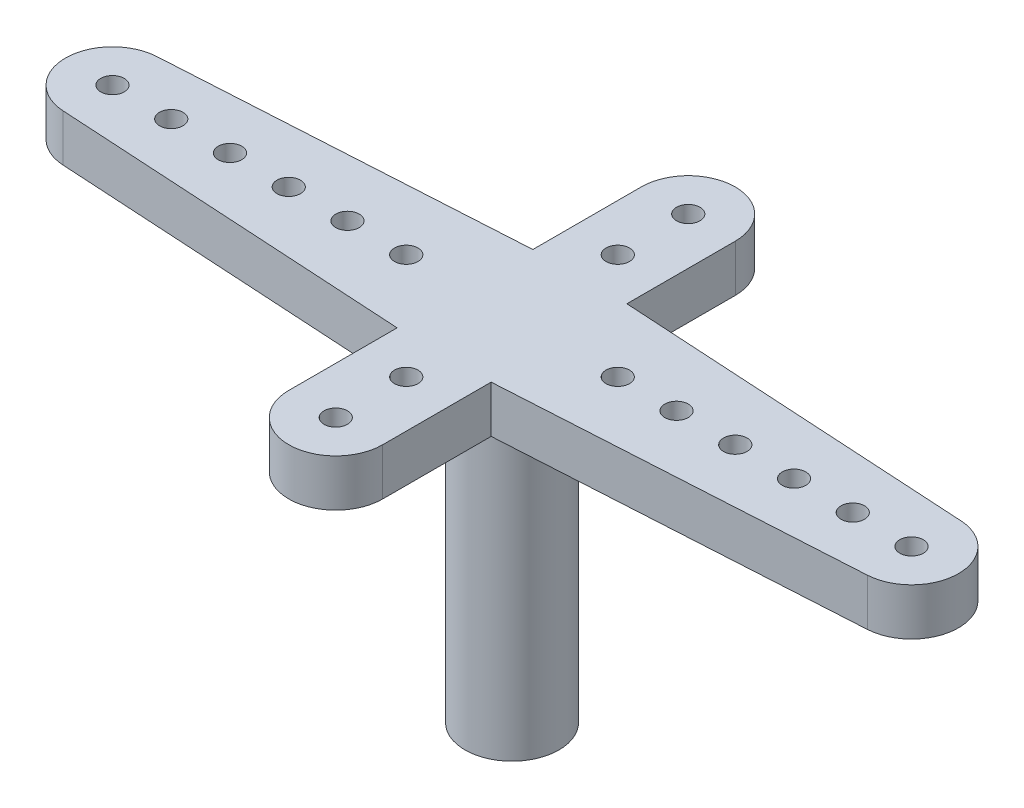
ISO-10303-21;
HEADER;
FILE_DESCRIPTION(('STEP AP214'),'2;1');
FILE_NAME('part.step','',(''),(''),'','','');
FILE_SCHEMA(('AUTOMOTIVE_DESIGN { 1 0 10303 214 1 1 1 1 }'));
ENDSEC;
DATA;
#1=APPLICATION_CONTEXT('core data for automotive mechanical design processes');
#2=APPLICATION_PROTOCOL_DEFINITION('international standard','automotive_design',2000,#1);
#3=PRODUCT_CONTEXT('',#1,'mechanical');
#4=PRODUCT('Part','Part','',(#3));
#5=PRODUCT_RELATED_PRODUCT_CATEGORY('part','',(#4));
#6=PRODUCT_DEFINITION_FORMATION('','',#4);
#7=PRODUCT_DEFINITION_CONTEXT('part definition',#1,'design');
#8=PRODUCT_DEFINITION('design','',#6,#7);
#9=PRODUCT_DEFINITION_SHAPE('','',#8);
#10=(LENGTH_UNIT() NAMED_UNIT(*) SI_UNIT(.MILLI.,.METRE.));
#11=(NAMED_UNIT(*) PLANE_ANGLE_UNIT() SI_UNIT($,.RADIAN.));
#12=(NAMED_UNIT(*) SI_UNIT($,.STERADIAN.) SOLID_ANGLE_UNIT());
#13=UNCERTAINTY_MEASURE_WITH_UNIT(LENGTH_MEASURE(1.E-05),#10,'distance_accuracy_value','');
#14=(GEOMETRIC_REPRESENTATION_CONTEXT(3) GLOBAL_UNCERTAINTY_ASSIGNED_CONTEXT((#13)) GLOBAL_UNIT_ASSIGNED_CONTEXT((#10,
#11,#12)) REPRESENTATION_CONTEXT('',''));
#15=CARTESIAN_POINT('',(0.,0.,0.));
#16=DIRECTION('',(0.,0.,1.));
#17=DIRECTION('',(1.,0.,0.));
#18=AXIS2_PLACEMENT_3D('',#15,#16,#17);
#19=CARTESIAN_POINT('',(17.,2.,0.));
#20=DIRECTION('',(0.,-1.,0.));
#21=DIRECTION('',(0.,0.,-1.));
#22=AXIS2_PLACEMENT_3D('',#19,#20,#21);
#23=PLANE('',#22);
#24=CARTESIAN_POINT('',(17.,2.,0.));
#25=DIRECTION('',(0.,1.,0.));
#26=DIRECTION('',(0.,0.,-1.));
#27=AXIS2_PLACEMENT_3D('',#24,#25,#26);
#28=CIRCLE('',#27,2.);
#29=CARTESIAN_POINT('',(17.1176470588235,2.,1.99653679393849));
#30=VERTEX_POINT('',#29);
#31=CARTESIAN_POINT('',(17.1176470588235,2.,-1.99653679393849));
#32=VERTEX_POINT('',#31);
#33=EDGE_CURVE('E179',#30,#32,#28,.T.);
#34=ORIENTED_EDGE('',*,*,#33,.T.);
#35=DIRECTION('',(-0.998268396969243,0.,-0.0588235294117646));
#36=VECTOR('',#35,1.);
#37=CARTESIAN_POINT('',(17.1176470588235,2.,-1.99653679393849));
#38=LINE('',#37,#36);
#39=CARTESIAN_POINT('',(2.,2.,-2.88735268984507));
#40=VERTEX_POINT('',#39);
#41=EDGE_CURVE('E107',#32,#40,#38,.T.);
#42=ORIENTED_EDGE('',*,*,#41,.T.);
#43=DIRECTION('',(0.,0.,-1.));
#44=VECTOR('',#43,1.);
#45=CARTESIAN_POINT('',(2.,2.,-7.5));
#46=LINE('',#45,#44);
#47=CARTESIAN_POINT('',(2.,2.,-7.5));
#48=VERTEX_POINT('',#47);
#49=EDGE_CURVE('E206',#40,#48,#46,.T.);
#50=ORIENTED_EDGE('',*,*,#49,.T.);
#51=CARTESIAN_POINT('',(0.,2.,-7.5));
#52=DIRECTION('',(0.,1.,0.));
#53=DIRECTION('',(0.,0.,-1.));
#54=AXIS2_PLACEMENT_3D('',#51,#52,#53);
#55=CIRCLE('',#54,2.);
#56=CARTESIAN_POINT('',(-2.,2.,-7.5));
#57=VERTEX_POINT('',#56);
#58=EDGE_CURVE('E225',#48,#57,#55,.T.);
#59=ORIENTED_EDGE('',*,*,#58,.T.);
#60=DIRECTION('',(0.,0.,1.));
#61=VECTOR('',#60,1.);
#62=CARTESIAN_POINT('',(-2.,2.,-7.5));
#63=LINE('',#62,#61);
#64=CARTESIAN_POINT('',(-2.,2.,-2.88735268984507));
#65=VERTEX_POINT('',#64);
#66=EDGE_CURVE('E222',#57,#65,#63,.T.);
#67=ORIENTED_EDGE('',*,*,#66,.T.);
#68=DIRECTION('',(-0.998268396969243,0.,0.0588235294117646));
#69=VECTOR('',#68,1.);
#70=CARTESIAN_POINT('',(-17.1176470588235,2.,-1.99653679393849));
#71=LINE('',#70,#69);
#72=CARTESIAN_POINT('',(-17.1176470588235,2.,-1.99653679393849));
#73=VERTEX_POINT('',#72);
#74=EDGE_CURVE('E224',#65,#73,#71,.T.);
#75=ORIENTED_EDGE('',*,*,#74,.T.);
#76=CARTESIAN_POINT('',(-17.,2.,0.));
#77=DIRECTION('',(0.,1.,0.));
#78=DIRECTION('',(0.,0.,1.));
#79=AXIS2_PLACEMENT_3D('',#76,#77,#78);
#80=CIRCLE('',#79,2.);
#81=CARTESIAN_POINT('',(-17.1176470588235,2.,1.99653679393849));
#82=VERTEX_POINT('',#81);
#83=EDGE_CURVE('E227',#73,#82,#80,.T.);
#84=ORIENTED_EDGE('',*,*,#83,.T.);
#85=DIRECTION('',(0.998268396969243,0.,0.0588235294117647));
#86=VECTOR('',#85,1.);
#87=CARTESIAN_POINT('',(-17.1176470588235,2.,1.99653679393849));
#88=LINE('',#87,#86);
#89=CARTESIAN_POINT('',(-2.,2.,2.88735268984507));
#90=VERTEX_POINT('',#89);
#91=EDGE_CURVE('E233',#82,#90,#88,.T.);
#92=ORIENTED_EDGE('',*,*,#91,.T.);
#93=DIRECTION('',(0.,0.,1.));
#94=VECTOR('',#93,1.);
#95=CARTESIAN_POINT('',(-2.,2.,7.5));
#96=LINE('',#95,#94);
#97=CARTESIAN_POINT('',(-2.,2.,7.5));
#98=VERTEX_POINT('',#97);
#99=EDGE_CURVE('E138',#90,#98,#96,.T.);
#100=ORIENTED_EDGE('',*,*,#99,.T.);
#101=CARTESIAN_POINT('',(0.,2.,7.5));
#102=DIRECTION('',(0.,1.,0.));
#103=DIRECTION('',(0.,0.,1.));
#104=AXIS2_PLACEMENT_3D('',#101,#102,#103);
#105=CIRCLE('',#104,2.);
#106=CARTESIAN_POINT('',(2.,2.,7.5));
#107=VERTEX_POINT('',#106);
#108=EDGE_CURVE('E132',#98,#107,#105,.T.);
#109=ORIENTED_EDGE('',*,*,#108,.T.);
#110=DIRECTION('',(0.,0.,-1.));
#111=VECTOR('',#110,1.);
#112=CARTESIAN_POINT('',(2.,2.,7.5));
#113=LINE('',#112,#111);
#114=CARTESIAN_POINT('',(2.,2.,2.88735268984507));
#115=VERTEX_POINT('',#114);
#116=EDGE_CURVE('E136',#107,#115,#113,.T.);
#117=ORIENTED_EDGE('',*,*,#116,.T.);
#118=DIRECTION('',(0.998268396969243,0.,-0.0588235294117647));
#119=VECTOR('',#118,1.);
#120=CARTESIAN_POINT('',(17.1176470588235,2.,1.99653679393849));
#121=LINE('',#120,#119);
#122=EDGE_CURVE('E52',#115,#30,#121,.T.);
#123=ORIENTED_EDGE('',*,*,#122,.T.);
#124=EDGE_LOOP('',(#34,#42,#50,#59,#67,#75,#84,#92,#100,#109,#117,#123));
#125=FACE_BOUND('',#124,.T.);
#126=CARTESIAN_POINT('',(-17.,2.,0.));
#127=DIRECTION('',(0.,1.,0.));
#128=DIRECTION('',(0.,0.,1.));
#129=AXIS2_PLACEMENT_3D('',#126,#127,#128);
#130=CIRCLE('',#129,0.499999999999999);
#131=CARTESIAN_POINT('',(-17.,2.,0.499999999999999));
#132=VERTEX_POINT('',#131);
#133=EDGE_CURVE('E160',#132,#132,#130,.T.);
#134=ORIENTED_EDGE('',*,*,#133,.F.);
#135=EDGE_LOOP('',(#134));
#136=FACE_BOUND('',#135,.T.);
#137=CARTESIAN_POINT('',(17.,2.,0.));
#138=DIRECTION('',(0.,1.,0.));
#139=DIRECTION('',(0.,0.,-1.));
#140=AXIS2_PLACEMENT_3D('',#137,#138,#139);
#141=CIRCLE('',#140,0.499999999999999);
#142=CARTESIAN_POINT('',(17.,2.,-0.499999999999999));
#143=VERTEX_POINT('',#142);
#144=EDGE_CURVE('E429',#143,#143,#141,.T.);
#145=ORIENTED_EDGE('',*,*,#144,.F.);
#146=EDGE_LOOP('',(#145));
#147=FACE_BOUND('',#146,.T.);
#148=CARTESIAN_POINT('',(-14.5,2.,0.));
#149=DIRECTION('',(0.,1.,0.));
#150=DIRECTION('',(0.,0.,1.));
#151=AXIS2_PLACEMENT_3D('',#148,#149,#150);
#152=CIRCLE('',#151,0.499999999999999);
#153=CARTESIAN_POINT('',(-14.5,2.,0.499999999999999));
#154=VERTEX_POINT('',#153);
#155=EDGE_CURVE('E423',#154,#154,#152,.T.);
#156=ORIENTED_EDGE('',*,*,#155,.F.);
#157=EDGE_LOOP('',(#156));
#158=FACE_BOUND('',#157,.T.);
#159=CARTESIAN_POINT('',(-12.,2.,0.));
#160=DIRECTION('',(0.,1.,0.));
#161=DIRECTION('',(0.,0.,1.));
#162=AXIS2_PLACEMENT_3D('',#159,#160,#161);
#163=CIRCLE('',#162,0.499999999999999);
#164=CARTESIAN_POINT('',(-12.,2.,0.499999999999999));
#165=VERTEX_POINT('',#164);
#166=EDGE_CURVE('E417',#165,#165,#163,.T.);
#167=ORIENTED_EDGE('',*,*,#166,.F.);
#168=EDGE_LOOP('',(#167));
#169=FACE_BOUND('',#168,.T.);
#170=CARTESIAN_POINT('',(-9.5,2.,0.));
#171=DIRECTION('',(0.,1.,0.));
#172=DIRECTION('',(0.,0.,1.));
#173=AXIS2_PLACEMENT_3D('',#170,#171,#172);
#174=CIRCLE('',#173,0.499999999999999);
#175=CARTESIAN_POINT('',(-9.5,2.,0.499999999999999));
#176=VERTEX_POINT('',#175);
#177=EDGE_CURVE('E411',#176,#176,#174,.T.);
#178=ORIENTED_EDGE('',*,*,#177,.F.);
#179=EDGE_LOOP('',(#178));
#180=FACE_BOUND('',#179,.T.);
#181=CARTESIAN_POINT('',(-7.,2.,0.));
#182=DIRECTION('',(0.,1.,0.));
#183=DIRECTION('',(0.,0.,1.));
#184=AXIS2_PLACEMENT_3D('',#181,#182,#183);
#185=CIRCLE('',#184,0.499999999999999);
#186=CARTESIAN_POINT('',(-7.,2.,0.499999999999999));
#187=VERTEX_POINT('',#186);
#188=EDGE_CURVE('E405',#187,#187,#185,.T.);
#189=ORIENTED_EDGE('',*,*,#188,.F.);
#190=EDGE_LOOP('',(#189));
#191=FACE_BOUND('',#190,.T.);
#192=CARTESIAN_POINT('',(-4.5,2.,0.));
#193=DIRECTION('',(0.,1.,0.));
#194=DIRECTION('',(0.,0.,1.));
#195=AXIS2_PLACEMENT_3D('',#192,#193,#194);
#196=CIRCLE('',#195,0.499999999999999);
#197=CARTESIAN_POINT('',(-4.5,2.,0.499999999999999));
#198=VERTEX_POINT('',#197);
#199=EDGE_CURVE('E399',#198,#198,#196,.T.);
#200=ORIENTED_EDGE('',*,*,#199,.F.);
#201=EDGE_LOOP('',(#200));
#202=FACE_BOUND('',#201,.T.);
#203=CARTESIAN_POINT('',(4.5,2.,0.));
#204=DIRECTION('',(0.,1.,0.));
#205=DIRECTION('',(0.,0.,-1.));
#206=AXIS2_PLACEMENT_3D('',#203,#204,#205);
#207=CIRCLE('',#206,0.499999999999999);
#208=CARTESIAN_POINT('',(4.5,2.,-0.499999999999999));
#209=VERTEX_POINT('',#208);
#210=EDGE_CURVE('E393',#209,#209,#207,.T.);
#211=ORIENTED_EDGE('',*,*,#210,.F.);
#212=EDGE_LOOP('',(#211));
#213=FACE_BOUND('',#212,.T.);
#214=CARTESIAN_POINT('',(7.,2.,0.));
#215=DIRECTION('',(0.,1.,0.));
#216=DIRECTION('',(0.,0.,-1.));
#217=AXIS2_PLACEMENT_3D('',#214,#215,#216);
#218=CIRCLE('',#217,0.499999999999999);
#219=CARTESIAN_POINT('',(7.,2.,-0.499999999999999));
#220=VERTEX_POINT('',#219);
#221=EDGE_CURVE('E387',#220,#220,#218,.T.);
#222=ORIENTED_EDGE('',*,*,#221,.F.);
#223=EDGE_LOOP('',(#222));
#224=FACE_BOUND('',#223,.T.);
#225=CARTESIAN_POINT('',(9.5,2.,0.));
#226=DIRECTION('',(0.,1.,0.));
#227=DIRECTION('',(0.,0.,-1.));
#228=AXIS2_PLACEMENT_3D('',#225,#226,#227);
#229=CIRCLE('',#228,0.499999999999999);
#230=CARTESIAN_POINT('',(9.5,2.,-0.499999999999999));
#231=VERTEX_POINT('',#230);
#232=EDGE_CURVE('E381',#231,#231,#229,.T.);
#233=ORIENTED_EDGE('',*,*,#232,.F.);
#234=EDGE_LOOP('',(#233));
#235=FACE_BOUND('',#234,.T.);
#236=CARTESIAN_POINT('',(12.,2.,0.));
#237=DIRECTION('',(0.,1.,0.));
#238=DIRECTION('',(0.,0.,-1.));
#239=AXIS2_PLACEMENT_3D('',#236,#237,#238);
#240=CIRCLE('',#239,0.499999999999999);
#241=CARTESIAN_POINT('',(12.,2.,-0.499999999999999));
#242=VERTEX_POINT('',#241);
#243=EDGE_CURVE('E375',#242,#242,#240,.T.);
#244=ORIENTED_EDGE('',*,*,#243,.F.);
#245=EDGE_LOOP('',(#244));
#246=FACE_BOUND('',#245,.T.);
#247=CARTESIAN_POINT('',(14.5,2.,0.));
#248=DIRECTION('',(0.,1.,0.));
#249=DIRECTION('',(0.,0.,-1.));
#250=AXIS2_PLACEMENT_3D('',#247,#248,#249);
#251=CIRCLE('',#250,0.499999999999999);
#252=CARTESIAN_POINT('',(14.5,2.,-0.499999999999999));
#253=VERTEX_POINT('',#252);
#254=EDGE_CURVE('E369',#253,#253,#251,.T.);
#255=ORIENTED_EDGE('',*,*,#254,.F.);
#256=EDGE_LOOP('',(#255));
#257=FACE_BOUND('',#256,.T.);
#258=CARTESIAN_POINT('',(0.,2.,-7.5));
#259=DIRECTION('',(0.,1.,0.));
#260=DIRECTION('',(0.,0.,1.));
#261=AXIS2_PLACEMENT_3D('',#258,#259,#260);
#262=CIRCLE('',#261,0.5);
#263=CARTESIAN_POINT('',(0.,2.,-7.));
#264=VERTEX_POINT('',#263);
#265=EDGE_CURVE('E363',#264,#264,#262,.T.);
#266=ORIENTED_EDGE('',*,*,#265,.F.);
#267=EDGE_LOOP('',(#266));
#268=FACE_BOUND('',#267,.T.);
#269=CARTESIAN_POINT('',(0.,2.,-4.5));
#270=DIRECTION('',(0.,1.,0.));
#271=DIRECTION('',(0.,0.,1.));
#272=AXIS2_PLACEMENT_3D('',#269,#270,#271);
#273=CIRCLE('',#272,0.5);
#274=CARTESIAN_POINT('',(0.,2.,-4.));
#275=VERTEX_POINT('',#274);
#276=EDGE_CURVE('E357',#275,#275,#273,.T.);
#277=ORIENTED_EDGE('',*,*,#276,.F.);
#278=EDGE_LOOP('',(#277));
#279=FACE_BOUND('',#278,.T.);
#280=CARTESIAN_POINT('',(0.,2.,4.5));
#281=DIRECTION('',(0.,1.,0.));
#282=DIRECTION('',(0.,0.,-1.));
#283=AXIS2_PLACEMENT_3D('',#280,#281,#282);
#284=CIRCLE('',#283,0.5);
#285=CARTESIAN_POINT('',(0.,2.,4.));
#286=VERTEX_POINT('',#285);
#287=EDGE_CURVE('E351',#286,#286,#284,.T.);
#288=ORIENTED_EDGE('',*,*,#287,.F.);
#289=EDGE_LOOP('',(#288));
#290=FACE_BOUND('',#289,.T.);
#291=CARTESIAN_POINT('',(0.,2.,7.5));
#292=DIRECTION('',(0.,1.,0.));
#293=DIRECTION('',(0.,0.,-1.));
#294=AXIS2_PLACEMENT_3D('',#291,#292,#293);
#295=CIRCLE('',#294,0.5);
#296=CARTESIAN_POINT('',(0.,2.,7.));
#297=VERTEX_POINT('',#296);
#298=EDGE_CURVE('E345',#297,#297,#295,.T.);
#299=ORIENTED_EDGE('',*,*,#298,.F.);
#300=EDGE_LOOP('',(#299));
#301=FACE_BOUND('',#300,.T.);
#302=ADVANCED_FACE('F35',(#125,#136,#147,#158,#169,#180,#191,#202,#213,#224,#235,#246,#257,#268,
#279,#290,#301),#23,.F.);
#303=CARTESIAN_POINT('',(17.,0.,0.));
#304=DIRECTION('',(0.,-1.,0.));
#305=DIRECTION('',(0.,0.,-1.));
#306=AXIS2_PLACEMENT_3D('',#303,#304,#305);
#307=PLANE('',#306);
#308=CARTESIAN_POINT('',(0.,0.,4.5));
#309=DIRECTION('',(0.,1.,0.));
#310=DIRECTION('',(0.,0.,-1.));
#311=AXIS2_PLACEMENT_3D('',#308,#309,#310);
#312=CIRCLE('',#311,0.5);
#313=CARTESIAN_POINT('',(0.,0.,4.));
#314=VERTEX_POINT('',#313);
#315=EDGE_CURVE('E348',#314,#314,#312,.T.);
#316=ORIENTED_EDGE('',*,*,#315,.T.);
#317=EDGE_LOOP('',(#316));
#318=FACE_BOUND('',#317,.T.);
#319=CARTESIAN_POINT('',(0.,0.,-7.5));
#320=DIRECTION('',(0.,1.,0.));
#321=DIRECTION('',(0.,0.,1.));
#322=AXIS2_PLACEMENT_3D('',#319,#320,#321);
#323=CIRCLE('',#322,0.5);
#324=CARTESIAN_POINT('',(0.,0.,-7.));
#325=VERTEX_POINT('',#324);
#326=EDGE_CURVE('E360',#325,#325,#323,.T.);
#327=ORIENTED_EDGE('',*,*,#326,.T.);
#328=EDGE_LOOP('',(#327));
#329=FACE_BOUND('',#328,.T.);
#330=CARTESIAN_POINT('',(12.,0.,0.));
#331=DIRECTION('',(0.,1.,0.));
#332=DIRECTION('',(0.,0.,-1.));
#333=AXIS2_PLACEMENT_3D('',#330,#331,#332);
#334=CIRCLE('',#333,0.499999999999999);
#335=CARTESIAN_POINT('',(12.,0.,-0.499999999999999));
#336=VERTEX_POINT('',#335);
#337=EDGE_CURVE('E372',#336,#336,#334,.T.);
#338=ORIENTED_EDGE('',*,*,#337,.T.);
#339=EDGE_LOOP('',(#338));
#340=FACE_BOUND('',#339,.T.);
#341=CARTESIAN_POINT('',(7.,0.,0.));
#342=DIRECTION('',(0.,1.,0.));
#343=DIRECTION('',(0.,0.,-1.));
#344=AXIS2_PLACEMENT_3D('',#341,#342,#343);
#345=CIRCLE('',#344,0.499999999999999);
#346=CARTESIAN_POINT('',(7.,0.,-0.499999999999999));
#347=VERTEX_POINT('',#346);
#348=EDGE_CURVE('E384',#347,#347,#345,.T.);
#349=ORIENTED_EDGE('',*,*,#348,.T.);
#350=EDGE_LOOP('',(#349));
#351=FACE_BOUND('',#350,.T.);
#352=CARTESIAN_POINT('',(-4.5,0.,0.));
#353=DIRECTION('',(0.,1.,0.));
#354=DIRECTION('',(0.,0.,1.));
#355=AXIS2_PLACEMENT_3D('',#352,#353,#354);
#356=CIRCLE('',#355,0.499999999999999);
#357=CARTESIAN_POINT('',(-4.5,0.,0.499999999999999));
#358=VERTEX_POINT('',#357);
#359=EDGE_CURVE('E396',#358,#358,#356,.T.);
#360=ORIENTED_EDGE('',*,*,#359,.T.);
#361=EDGE_LOOP('',(#360));
#362=FACE_BOUND('',#361,.T.);
#363=CARTESIAN_POINT('',(-9.5,0.,0.));
#364=DIRECTION('',(0.,1.,0.));
#365=DIRECTION('',(0.,0.,1.));
#366=AXIS2_PLACEMENT_3D('',#363,#364,#365);
#367=CIRCLE('',#366,0.499999999999999);
#368=CARTESIAN_POINT('',(-9.5,0.,0.499999999999999));
#369=VERTEX_POINT('',#368);
#370=EDGE_CURVE('E408',#369,#369,#367,.T.);
#371=ORIENTED_EDGE('',*,*,#370,.T.);
#372=EDGE_LOOP('',(#371));
#373=FACE_BOUND('',#372,.T.);
#374=CARTESIAN_POINT('',(-14.5,0.,0.));
#375=DIRECTION('',(0.,1.,0.));
#376=DIRECTION('',(0.,0.,1.));
#377=AXIS2_PLACEMENT_3D('',#374,#375,#376);
#378=CIRCLE('',#377,0.499999999999999);
#379=CARTESIAN_POINT('',(-14.5,0.,0.499999999999999));
#380=VERTEX_POINT('',#379);
#381=EDGE_CURVE('E420',#380,#380,#378,.T.);
#382=ORIENTED_EDGE('',*,*,#381,.T.);
#383=EDGE_LOOP('',(#382));
#384=FACE_BOUND('',#383,.T.);
#385=CARTESIAN_POINT('',(-17.,0.,0.));
#386=DIRECTION('',(0.,1.,0.));
#387=DIRECTION('',(0.,0.,1.));
#388=AXIS2_PLACEMENT_3D('',#385,#386,#387);
#389=CIRCLE('',#388,0.499999999999999);
#390=CARTESIAN_POINT('',(-17.,0.,0.499999999999999));
#391=VERTEX_POINT('',#390);
#392=EDGE_CURVE('E432',#391,#391,#389,.T.);
#393=ORIENTED_EDGE('',*,*,#392,.T.);
#394=EDGE_LOOP('',(#393));
#395=FACE_BOUND('',#394,.T.);
#396=CARTESIAN_POINT('',(17.,0.,0.));
#397=DIRECTION('',(0.,1.,0.));
#398=DIRECTION('',(0.,0.,-1.));
#399=AXIS2_PLACEMENT_3D('',#396,#397,#398);
#400=CIRCLE('',#399,2.);
#401=CARTESIAN_POINT('',(17.1176470588235,0.,1.99653679393849));
#402=VERTEX_POINT('',#401);
#403=CARTESIAN_POINT('',(17.1176470588235,0.,-1.99653679393849));
#404=VERTEX_POINT('',#403);
#405=EDGE_CURVE('E156',#402,#404,#400,.T.);
#406=ORIENTED_EDGE('',*,*,#405,.F.);
#407=DIRECTION('',(0.998268396969243,0.,-0.0588235294117647));
#408=VECTOR('',#407,1.);
#409=CARTESIAN_POINT('',(17.1176470588235,0.,1.99653679393849));
#410=LINE('',#409,#408);
#411=CARTESIAN_POINT('',(2.,0.,2.88735268984507));
#412=VERTEX_POINT('',#411);
#413=EDGE_CURVE('E99',#412,#402,#410,.T.);
#414=ORIENTED_EDGE('',*,*,#413,.F.);
#415=DIRECTION('',(0.,0.,-1.));
#416=VECTOR('',#415,1.);
#417=CARTESIAN_POINT('',(2.,0.,7.5));
#418=LINE('',#417,#416);
#419=CARTESIAN_POINT('',(2.,0.,7.5));
#420=VERTEX_POINT('',#419);
#421=EDGE_CURVE('E93',#420,#412,#418,.T.);
#422=ORIENTED_EDGE('',*,*,#421,.F.);
#423=CARTESIAN_POINT('',(0.,0.,7.5));
#424=DIRECTION('',(0.,1.,0.));
#425=DIRECTION('',(0.,0.,1.));
#426=AXIS2_PLACEMENT_3D('',#423,#424,#425);
#427=CIRCLE('',#426,2.);
#428=CARTESIAN_POINT('',(-2.,0.,7.5));
#429=VERTEX_POINT('',#428);
#430=EDGE_CURVE('E146',#429,#420,#427,.T.);
#431=ORIENTED_EDGE('',*,*,#430,.F.);
#432=DIRECTION('',(0.,0.,1.));
#433=VECTOR('',#432,1.);
#434=CARTESIAN_POINT('',(-2.,0.,7.5));
#435=LINE('',#434,#433);
#436=CARTESIAN_POINT('',(-2.,0.,2.88735268984507));
#437=VERTEX_POINT('',#436);
#438=EDGE_CURVE('E174',#437,#429,#435,.T.);
#439=ORIENTED_EDGE('',*,*,#438,.F.);
#440=DIRECTION('',(0.998268396969243,0.,0.0588235294117647));
#441=VECTOR('',#440,1.);
#442=CARTESIAN_POINT('',(-17.1176470588235,0.,1.99653679393849));
#443=LINE('',#442,#441);
#444=CARTESIAN_POINT('',(-17.1176470588235,0.,1.99653679393849));
#445=VERTEX_POINT('',#444);
#446=EDGE_CURVE('E172',#445,#437,#443,.T.);
#447=ORIENTED_EDGE('',*,*,#446,.F.);
#448=CARTESIAN_POINT('',(-17.,0.,0.));
#449=DIRECTION('',(0.,1.,0.));
#450=DIRECTION('',(0.,0.,1.));
#451=AXIS2_PLACEMENT_3D('',#448,#449,#450);
#452=CIRCLE('',#451,2.);
#453=CARTESIAN_POINT('',(-17.1176470588235,0.,-1.99653679393849));
#454=VERTEX_POINT('',#453);
#455=EDGE_CURVE('E170',#454,#445,#452,.T.);
#456=ORIENTED_EDGE('',*,*,#455,.F.);
#457=DIRECTION('',(-0.998268396969243,0.,0.0588235294117646));
#458=VECTOR('',#457,1.);
#459=CARTESIAN_POINT('',(-17.1176470588235,0.,-1.99653679393849));
#460=LINE('',#459,#458);
#461=CARTESIAN_POINT('',(-2.,0.,-2.88735268984507));
#462=VERTEX_POINT('',#461);
#463=EDGE_CURVE('E168',#462,#454,#460,.T.);
#464=ORIENTED_EDGE('',*,*,#463,.F.);
#465=DIRECTION('',(0.,0.,1.));
#466=VECTOR('',#465,1.);
#467=CARTESIAN_POINT('',(-2.,0.,-7.5));
#468=LINE('',#467,#466);
#469=CARTESIAN_POINT('',(-2.,0.,-7.5));
#470=VERTEX_POINT('',#469);
#471=EDGE_CURVE('E166',#470,#462,#468,.T.);
#472=ORIENTED_EDGE('',*,*,#471,.F.);
#473=CARTESIAN_POINT('',(0.,0.,-7.5));
#474=DIRECTION('',(0.,1.,0.));
#475=DIRECTION('',(0.,0.,-1.));
#476=AXIS2_PLACEMENT_3D('',#473,#474,#475);
#477=CIRCLE('',#476,2.);
#478=CARTESIAN_POINT('',(2.,0.,-7.5));
#479=VERTEX_POINT('',#478);
#480=EDGE_CURVE('E164',#479,#470,#477,.T.);
#481=ORIENTED_EDGE('',*,*,#480,.F.);
#482=DIRECTION('',(0.,0.,-1.));
#483=VECTOR('',#482,1.);
#484=CARTESIAN_POINT('',(2.,0.,-7.5));
#485=LINE('',#484,#483);
#486=CARTESIAN_POINT('',(2.,0.,-2.88735268984507));
#487=VERTEX_POINT('',#486);
#488=EDGE_CURVE('E162',#487,#479,#485,.T.);
#489=ORIENTED_EDGE('',*,*,#488,.F.);
#490=DIRECTION('',(-0.998268396969243,0.,-0.0588235294117646));
#491=VECTOR('',#490,1.);
#492=CARTESIAN_POINT('',(17.1176470588235,0.,-1.99653679393849));
#493=LINE('',#492,#491);
#494=EDGE_CURVE('E159',#404,#487,#493,.T.);
#495=ORIENTED_EDGE('',*,*,#494,.F.);
#496=EDGE_LOOP('',(#406,#414,#422,#431,#439,#447,#456,#464,#472,#481,#489,#495));
#497=FACE_BOUND('',#496,.T.);
#498=CARTESIAN_POINT('',(0.,0.,0.));
#499=DIRECTION('',(0.,-1.,0.));
#500=DIRECTION('',(0.,0.,-1.));
#501=AXIS2_PLACEMENT_3D('',#498,#499,#500);
#502=CIRCLE('',#501,2.);
#503=CARTESIAN_POINT('',(0.,0.,-2.));
#504=VERTEX_POINT('',#503);
#505=EDGE_CURVE('E339',#504,#504,#502,.F.);
#506=ORIENTED_EDGE('',*,*,#505,.T.);
#507=EDGE_LOOP('',(#506));
#508=FACE_BOUND('',#507,.T.);
#509=CARTESIAN_POINT('',(17.,0.,0.));
#510=DIRECTION('',(0.,1.,0.));
#511=DIRECTION('',(0.,0.,-1.));
#512=AXIS2_PLACEMENT_3D('',#509,#510,#511);
#513=CIRCLE('',#512,0.499999999999999);
#514=CARTESIAN_POINT('',(17.,0.,-0.499999999999999));
#515=VERTEX_POINT('',#514);
#516=EDGE_CURVE('E426',#515,#515,#513,.T.);
#517=ORIENTED_EDGE('',*,*,#516,.T.);
#518=EDGE_LOOP('',(#517));
#519=FACE_BOUND('',#518,.T.);
#520=CARTESIAN_POINT('',(-12.,0.,0.));
#521=DIRECTION('',(0.,1.,0.));
#522=DIRECTION('',(0.,0.,1.));
#523=AXIS2_PLACEMENT_3D('',#520,#521,#522);
#524=CIRCLE('',#523,0.499999999999999);
#525=CARTESIAN_POINT('',(-12.,0.,0.499999999999999));
#526=VERTEX_POINT('',#525);
#527=EDGE_CURVE('E414',#526,#526,#524,.T.);
#528=ORIENTED_EDGE('',*,*,#527,.T.);
#529=EDGE_LOOP('',(#528));
#530=FACE_BOUND('',#529,.T.);
#531=CARTESIAN_POINT('',(-7.,0.,0.));
#532=DIRECTION('',(0.,1.,0.));
#533=DIRECTION('',(0.,0.,1.));
#534=AXIS2_PLACEMENT_3D('',#531,#532,#533);
#535=CIRCLE('',#534,0.499999999999999);
#536=CARTESIAN_POINT('',(-7.,0.,0.499999999999999));
#537=VERTEX_POINT('',#536);
#538=EDGE_CURVE('E402',#537,#537,#535,.T.);
#539=ORIENTED_EDGE('',*,*,#538,.T.);
#540=EDGE_LOOP('',(#539));
#541=FACE_BOUND('',#540,.T.);
#542=CARTESIAN_POINT('',(4.5,0.,0.));
#543=DIRECTION('',(0.,1.,0.));
#544=DIRECTION('',(0.,0.,-1.));
#545=AXIS2_PLACEMENT_3D('',#542,#543,#544);
#546=CIRCLE('',#545,0.499999999999999);
#547=CARTESIAN_POINT('',(4.5,0.,-0.499999999999999));
#548=VERTEX_POINT('',#547);
#549=EDGE_CURVE('E390',#548,#548,#546,.T.);
#550=ORIENTED_EDGE('',*,*,#549,.T.);
#551=EDGE_LOOP('',(#550));
#552=FACE_BOUND('',#551,.T.);
#553=CARTESIAN_POINT('',(9.5,0.,0.));
#554=DIRECTION('',(0.,1.,0.));
#555=DIRECTION('',(0.,0.,-1.));
#556=AXIS2_PLACEMENT_3D('',#553,#554,#555);
#557=CIRCLE('',#556,0.499999999999999);
#558=CARTESIAN_POINT('',(9.5,0.,-0.499999999999999));
#559=VERTEX_POINT('',#558);
#560=EDGE_CURVE('E378',#559,#559,#557,.T.);
#561=ORIENTED_EDGE('',*,*,#560,.T.);
#562=EDGE_LOOP('',(#561));
#563=FACE_BOUND('',#562,.T.);
#564=CARTESIAN_POINT('',(14.5,0.,0.));
#565=DIRECTION('',(0.,1.,0.));
#566=DIRECTION('',(0.,0.,-1.));
#567=AXIS2_PLACEMENT_3D('',#564,#565,#566);
#568=CIRCLE('',#567,0.499999999999999);
#569=CARTESIAN_POINT('',(14.5,0.,-0.499999999999999));
#570=VERTEX_POINT('',#569);
#571=EDGE_CURVE('E366',#570,#570,#568,.T.);
#572=ORIENTED_EDGE('',*,*,#571,.T.);
#573=EDGE_LOOP('',(#572));
#574=FACE_BOUND('',#573,.T.);
#575=CARTESIAN_POINT('',(0.,0.,-4.5));
#576=DIRECTION('',(0.,1.,0.));
#577=DIRECTION('',(0.,0.,1.));
#578=AXIS2_PLACEMENT_3D('',#575,#576,#577);
#579=CIRCLE('',#578,0.5);
#580=CARTESIAN_POINT('',(0.,0.,-4.));
#581=VERTEX_POINT('',#580);
#582=EDGE_CURVE('E354',#581,#581,#579,.T.);
#583=ORIENTED_EDGE('',*,*,#582,.T.);
#584=EDGE_LOOP('',(#583));
#585=FACE_BOUND('',#584,.T.);
#586=CARTESIAN_POINT('',(0.,0.,7.5));
#587=DIRECTION('',(0.,1.,0.));
#588=DIRECTION('',(0.,0.,-1.));
#589=AXIS2_PLACEMENT_3D('',#586,#587,#588);
#590=CIRCLE('',#589,0.5);
#591=CARTESIAN_POINT('',(0.,0.,7.));
#592=VERTEX_POINT('',#591);
#593=EDGE_CURVE('E342',#592,#592,#590,.T.);
#594=ORIENTED_EDGE('',*,*,#593,.T.);
#595=EDGE_LOOP('',(#594));
#596=FACE_BOUND('',#595,.T.);
#597=ADVANCED_FACE('F210',(#318,#329,#340,#351,#362,#373,#384,#395,#497,#508,#519,#530,#541,
#552,#563,#574,#585,#596),#307,.T.);
#598=CARTESIAN_POINT('',(17.,2.,0.));
#599=DIRECTION('',(0.,-1.,0.));
#600=DIRECTION('',(0.,0.,-1.));
#601=AXIS2_PLACEMENT_3D('',#598,#599,#600);
#602=CYLINDRICAL_SURFACE('',#601,2.);
#603=ORIENTED_EDGE('',*,*,#405,.T.);
#604=DIRECTION('',(0.,-1.,0.));
#605=VECTOR('',#604,1.);
#606=CARTESIAN_POINT('',(17.1176470588235,2.,-1.99653679393849));
#607=LINE('',#606,#605);
#608=EDGE_CURVE('E11',#32,#404,#607,.T.);
#609=ORIENTED_EDGE('',*,*,#608,.F.);
#610=ORIENTED_EDGE('',*,*,#33,.F.);
#611=DIRECTION('',(0.,-1.,0.));
#612=VECTOR('',#611,1.);
#613=CARTESIAN_POINT('',(17.1176470588235,2.,1.99653679393849));
#614=LINE('',#613,#612);
#615=EDGE_CURVE('E152',#30,#402,#614,.T.);
#616=ORIENTED_EDGE('',*,*,#615,.T.);
#617=EDGE_LOOP('',(#603,#609,#610,#616));
#618=FACE_BOUND('',#617,.T.);
#619=ADVANCED_FACE('F37',(#618),#602,.T.);
#620=CARTESIAN_POINT('',(17.1176470588235,2.,-1.99653679393849));
#621=DIRECTION('',(-0.0588235294117647,0.,0.998268396969244));
#622=DIRECTION('',(0.998268396969244,0.,0.0588235294117647));
#623=AXIS2_PLACEMENT_3D('',#620,#621,#622);
#624=PLANE('',#623);
#625=ORIENTED_EDGE('',*,*,#494,.T.);
#626=DIRECTION('',(0.,-1.,0.));
#627=VECTOR('',#626,1.);
#628=CARTESIAN_POINT('',(2.,2.,-2.88735268984507));
#629=LINE('',#628,#627);
#630=EDGE_CURVE('E44',#40,#487,#629,.T.);
#631=ORIENTED_EDGE('',*,*,#630,.F.);
#632=ORIENTED_EDGE('',*,*,#41,.F.);
#633=ORIENTED_EDGE('',*,*,#608,.T.);
#634=EDGE_LOOP('',(#625,#631,#632,#633));
#635=FACE_BOUND('',#634,.T.);
#636=ADVANCED_FACE('F666',(#635),#624,.F.);
#637=CARTESIAN_POINT('',(2.,2.,-7.5));
#638=DIRECTION('',(-1.,0.,0.));
#639=DIRECTION('',(0.,0.,1.));
#640=AXIS2_PLACEMENT_3D('',#637,#638,#639);
#641=PLANE('',#640);
#642=ORIENTED_EDGE('',*,*,#488,.T.);
#643=DIRECTION('',(0.,-1.,0.));
#644=VECTOR('',#643,1.);
#645=CARTESIAN_POINT('',(2.,2.,-7.5));
#646=LINE('',#645,#644);
#647=EDGE_CURVE('E198',#48,#479,#646,.T.);
#648=ORIENTED_EDGE('',*,*,#647,.F.);
#649=ORIENTED_EDGE('',*,*,#49,.F.);
#650=ORIENTED_EDGE('',*,*,#630,.T.);
#651=EDGE_LOOP('',(#642,#648,#649,#650));
#652=FACE_BOUND('',#651,.T.);
#653=ADVANCED_FACE('F204',(#652),#641,.F.);
#654=CARTESIAN_POINT('',(0.,2.,-7.5));
#655=DIRECTION('',(0.,-1.,0.));
#656=DIRECTION('',(0.,0.,-1.));
#657=AXIS2_PLACEMENT_3D('',#654,#655,#656);
#658=CYLINDRICAL_SURFACE('',#657,2.);
#659=ORIENTED_EDGE('',*,*,#480,.T.);
#660=DIRECTION('',(0.,-1.,0.));
#661=VECTOR('',#660,1.);
#662=CARTESIAN_POINT('',(-2.,2.,-7.5));
#663=LINE('',#662,#661);
#664=EDGE_CURVE('E195',#57,#470,#663,.T.);
#665=ORIENTED_EDGE('',*,*,#664,.F.);
#666=ORIENTED_EDGE('',*,*,#58,.F.);
#667=ORIENTED_EDGE('',*,*,#647,.T.);
#668=EDGE_LOOP('',(#659,#665,#666,#667));
#669=FACE_BOUND('',#668,.T.);
#670=ADVANCED_FACE('F216',(#669),#658,.T.);
#671=CARTESIAN_POINT('',(-2.,2.,-7.5));
#672=DIRECTION('',(1.,0.,0.));
#673=DIRECTION('',(0.,0.,-1.));
#674=AXIS2_PLACEMENT_3D('',#671,#672,#673);
#675=PLANE('',#674);
#676=ORIENTED_EDGE('',*,*,#471,.T.);
#677=DIRECTION('',(0.,-1.,0.));
#678=VECTOR('',#677,1.);
#679=CARTESIAN_POINT('',(-2.,2.,-2.88735268984507));
#680=LINE('',#679,#678);
#681=EDGE_CURVE('E192',#65,#462,#680,.T.);
#682=ORIENTED_EDGE('',*,*,#681,.F.);
#683=ORIENTED_EDGE('',*,*,#66,.F.);
#684=ORIENTED_EDGE('',*,*,#664,.T.);
#685=EDGE_LOOP('',(#676,#682,#683,#684));
#686=FACE_BOUND('',#685,.T.);
#687=ADVANCED_FACE('F220',(#686),#675,.F.);
#688=CARTESIAN_POINT('',(-17.1176470588235,2.,-1.99653679393849));
#689=DIRECTION('',(0.0588235294117647,0.,0.998268396969244));
#690=DIRECTION('',(0.998268396969244,0.,-0.0588235294117647));
#691=AXIS2_PLACEMENT_3D('',#688,#689,#690);
#692=PLANE('',#691);
#693=ORIENTED_EDGE('',*,*,#463,.T.);
#694=DIRECTION('',(0.,-1.,0.));
#695=VECTOR('',#694,1.);
#696=CARTESIAN_POINT('',(-17.1176470588235,2.,-1.99653679393849));
#697=LINE('',#696,#695);
#698=EDGE_CURVE('E189',#73,#454,#697,.T.);
#699=ORIENTED_EDGE('',*,*,#698,.F.);
#700=ORIENTED_EDGE('',*,*,#74,.F.);
#701=ORIENTED_EDGE('',*,*,#681,.T.);
#702=EDGE_LOOP('',(#693,#699,#700,#701));
#703=FACE_BOUND('',#702,.T.);
#704=ADVANCED_FACE('F631',(#703),#692,.F.);
#705=CARTESIAN_POINT('',(-17.,2.,0.));
#706=DIRECTION('',(0.,-1.,0.));
#707=DIRECTION('',(0.,0.,-1.));
#708=AXIS2_PLACEMENT_3D('',#705,#706,#707);
#709=CYLINDRICAL_SURFACE('',#708,2.);
#710=ORIENTED_EDGE('',*,*,#455,.T.);
#711=DIRECTION('',(0.,-1.,0.));
#712=VECTOR('',#711,1.);
#713=CARTESIAN_POINT('',(-17.1176470588235,2.,1.99653679393849));
#714=LINE('',#713,#712);
#715=EDGE_CURVE('E186',#82,#445,#714,.T.);
#716=ORIENTED_EDGE('',*,*,#715,.F.);
#717=ORIENTED_EDGE('',*,*,#83,.F.);
#718=ORIENTED_EDGE('',*,*,#698,.T.);
#719=EDGE_LOOP('',(#710,#716,#717,#718));
#720=FACE_BOUND('',#719,.T.);
#721=ADVANCED_FACE('F622',(#720),#709,.T.);
#722=CARTESIAN_POINT('',(-17.1176470588235,2.,1.99653679393849));
#723=DIRECTION('',(0.0588235294117647,0.,-0.998268396969244));
#724=DIRECTION('',(-0.998268396969244,0.,-0.0588235294117647));
#725=AXIS2_PLACEMENT_3D('',#722,#723,#724);
#726=PLANE('',#725);
#727=ORIENTED_EDGE('',*,*,#446,.T.);
#728=DIRECTION('',(0.,-1.,0.));
#729=VECTOR('',#728,1.);
#730=CARTESIAN_POINT('',(-2.,2.,2.88735268984507));
#731=LINE('',#730,#729);
#732=EDGE_CURVE('E183',#90,#437,#731,.T.);
#733=ORIENTED_EDGE('',*,*,#732,.F.);
#734=ORIENTED_EDGE('',*,*,#91,.F.);
#735=ORIENTED_EDGE('',*,*,#715,.T.);
#736=EDGE_LOOP('',(#727,#733,#734,#735));
#737=FACE_BOUND('',#736,.T.);
#738=ADVANCED_FACE('F239',(#737),#726,.F.);
#739=CARTESIAN_POINT('',(-2.,2.,7.5));
#740=DIRECTION('',(1.,0.,0.));
#741=DIRECTION('',(0.,0.,-1.));
#742=AXIS2_PLACEMENT_3D('',#739,#740,#741);
#743=PLANE('',#742);
#744=ORIENTED_EDGE('',*,*,#438,.T.);
#745=DIRECTION('',(0.,-1.,0.));
#746=VECTOR('',#745,1.);
#747=CARTESIAN_POINT('',(-2.,2.,7.5));
#748=LINE('',#747,#746);
#749=EDGE_CURVE('E147',#98,#429,#748,.T.);
#750=ORIENTED_EDGE('',*,*,#749,.F.);
#751=ORIENTED_EDGE('',*,*,#99,.F.);
#752=ORIENTED_EDGE('',*,*,#732,.T.);
#753=EDGE_LOOP('',(#744,#750,#751,#752));
#754=FACE_BOUND('',#753,.T.);
#755=ADVANCED_FACE('F243',(#754),#743,.F.);
#756=CARTESIAN_POINT('',(0.,2.,7.5));
#757=DIRECTION('',(0.,-1.,0.));
#758=DIRECTION('',(0.,0.,-1.));
#759=AXIS2_PLACEMENT_3D('',#756,#757,#758);
#760=CYLINDRICAL_SURFACE('',#759,2.);
#761=ORIENTED_EDGE('',*,*,#430,.T.);
#762=DIRECTION('',(0.,-1.,0.));
#763=VECTOR('',#762,1.);
#764=CARTESIAN_POINT('',(2.,2.,7.5));
#765=LINE('',#764,#763);
#766=EDGE_CURVE('E143',#107,#420,#765,.T.);
#767=ORIENTED_EDGE('',*,*,#766,.F.);
#768=ORIENTED_EDGE('',*,*,#108,.F.);
#769=ORIENTED_EDGE('',*,*,#749,.T.);
#770=EDGE_LOOP('',(#761,#767,#768,#769));
#771=FACE_BOUND('',#770,.T.);
#772=ADVANCED_FACE('F144',(#771),#760,.T.);
#773=CARTESIAN_POINT('',(2.,2.,7.5));
#774=DIRECTION('',(-1.,0.,0.));
#775=DIRECTION('',(0.,0.,1.));
#776=AXIS2_PLACEMENT_3D('',#773,#774,#775);
#777=PLANE('',#776);
#778=ORIENTED_EDGE('',*,*,#421,.T.);
#779=DIRECTION('',(0.,-1.,0.));
#780=VECTOR('',#779,1.);
#781=CARTESIAN_POINT('',(2.,2.,2.88735268984507));
#782=LINE('',#781,#780);
#783=EDGE_CURVE('E148',#115,#412,#782,.T.);
#784=ORIENTED_EDGE('',*,*,#783,.F.);
#785=ORIENTED_EDGE('',*,*,#116,.F.);
#786=ORIENTED_EDGE('',*,*,#766,.T.);
#787=EDGE_LOOP('',(#778,#784,#785,#786));
#788=FACE_BOUND('',#787,.T.);
#789=ADVANCED_FACE('F150',(#788),#777,.F.);
#790=CARTESIAN_POINT('',(17.1176470588235,2.,1.99653679393849));
#791=DIRECTION('',(-0.0588235294117647,0.,-0.998268396969244));
#792=DIRECTION('',(-0.998268396969244,0.,0.0588235294117647));
#793=AXIS2_PLACEMENT_3D('',#790,#791,#792);
#794=PLANE('',#793);
#795=ORIENTED_EDGE('',*,*,#413,.T.);
#796=ORIENTED_EDGE('',*,*,#615,.F.);
#797=ORIENTED_EDGE('',*,*,#122,.F.);
#798=ORIENTED_EDGE('',*,*,#783,.T.);
#799=EDGE_LOOP('',(#795,#796,#797,#798));
#800=FACE_BOUND('',#799,.T.);
#801=ADVANCED_FACE('F247',(#800),#794,.F.);
#802=CARTESIAN_POINT('',(-17.,2.,0.));
#803=DIRECTION('',(0.,-1.,0.));
#804=DIRECTION('',(0.,0.,-1.));
#805=AXIS2_PLACEMENT_3D('',#802,#803,#804);
#806=CYLINDRICAL_SURFACE('',#805,0.499999999999999);
#807=ORIENTED_EDGE('',*,*,#133,.T.);
#808=EDGE_LOOP('',(#807));
#809=FACE_BOUND('',#808,.T.);
#810=ORIENTED_EDGE('',*,*,#392,.F.);
#811=EDGE_LOOP('',(#810));
#812=FACE_BOUND('',#811,.T.);
#813=ADVANCED_FACE('F249',(#809,#812),#806,.F.);
#814=CARTESIAN_POINT('',(17.,2.,0.));
#815=DIRECTION('',(0.,-1.,0.));
#816=DIRECTION('',(0.,0.,-1.));
#817=AXIS2_PLACEMENT_3D('',#814,#815,#816);
#818=CYLINDRICAL_SURFACE('',#817,0.499999999999999);
#819=ORIENTED_EDGE('',*,*,#144,.T.);
#820=EDGE_LOOP('',(#819));
#821=FACE_BOUND('',#820,.T.);
#822=ORIENTED_EDGE('',*,*,#516,.F.);
#823=EDGE_LOOP('',(#822));
#824=FACE_BOUND('',#823,.T.);
#825=ADVANCED_FACE('F255',(#821,#824),#818,.F.);
#826=CARTESIAN_POINT('',(-14.5,2.,0.));
#827=DIRECTION('',(0.,-1.,0.));
#828=DIRECTION('',(0.,0.,-1.));
#829=AXIS2_PLACEMENT_3D('',#826,#827,#828);
#830=CYLINDRICAL_SURFACE('',#829,0.499999999999999);
#831=ORIENTED_EDGE('',*,*,#155,.T.);
#832=EDGE_LOOP('',(#831));
#833=FACE_BOUND('',#832,.T.);
#834=ORIENTED_EDGE('',*,*,#381,.F.);
#835=EDGE_LOOP('',(#834));
#836=FACE_BOUND('',#835,.T.);
#837=ADVANCED_FACE('F269',(#833,#836),#830,.F.);
#838=CARTESIAN_POINT('',(-12.,2.,0.));
#839=DIRECTION('',(0.,-1.,0.));
#840=DIRECTION('',(0.,0.,-1.));
#841=AXIS2_PLACEMENT_3D('',#838,#839,#840);
#842=CYLINDRICAL_SURFACE('',#841,0.499999999999999);
#843=ORIENTED_EDGE('',*,*,#166,.T.);
#844=EDGE_LOOP('',(#843));
#845=FACE_BOUND('',#844,.T.);
#846=ORIENTED_EDGE('',*,*,#527,.F.);
#847=EDGE_LOOP('',(#846));
#848=FACE_BOUND('',#847,.T.);
#849=ADVANCED_FACE('F273',(#845,#848),#842,.F.);
#850=CARTESIAN_POINT('',(-9.5,2.,0.));
#851=DIRECTION('',(0.,-1.,0.));
#852=DIRECTION('',(0.,0.,-1.));
#853=AXIS2_PLACEMENT_3D('',#850,#851,#852);
#854=CYLINDRICAL_SURFACE('',#853,0.499999999999999);
#855=ORIENTED_EDGE('',*,*,#177,.T.);
#856=EDGE_LOOP('',(#855));
#857=FACE_BOUND('',#856,.T.);
#858=ORIENTED_EDGE('',*,*,#370,.F.);
#859=EDGE_LOOP('',(#858));
#860=FACE_BOUND('',#859,.T.);
#861=ADVANCED_FACE('F277',(#857,#860),#854,.F.);
#862=CARTESIAN_POINT('',(-7.,2.,0.));
#863=DIRECTION('',(0.,-1.,0.));
#864=DIRECTION('',(0.,0.,-1.));
#865=AXIS2_PLACEMENT_3D('',#862,#863,#864);
#866=CYLINDRICAL_SURFACE('',#865,0.499999999999999);
#867=ORIENTED_EDGE('',*,*,#188,.T.);
#868=EDGE_LOOP('',(#867));
#869=FACE_BOUND('',#868,.T.);
#870=ORIENTED_EDGE('',*,*,#538,.F.);
#871=EDGE_LOOP('',(#870));
#872=FACE_BOUND('',#871,.T.);
#873=ADVANCED_FACE('F281',(#869,#872),#866,.F.);
#874=CARTESIAN_POINT('',(-4.5,2.,0.));
#875=DIRECTION('',(0.,-1.,0.));
#876=DIRECTION('',(0.,0.,-1.));
#877=AXIS2_PLACEMENT_3D('',#874,#875,#876);
#878=CYLINDRICAL_SURFACE('',#877,0.499999999999999);
#879=ORIENTED_EDGE('',*,*,#199,.T.);
#880=EDGE_LOOP('',(#879));
#881=FACE_BOUND('',#880,.T.);
#882=ORIENTED_EDGE('',*,*,#359,.F.);
#883=EDGE_LOOP('',(#882));
#884=FACE_BOUND('',#883,.T.);
#885=ADVANCED_FACE('F285',(#881,#884),#878,.F.);
#886=CARTESIAN_POINT('',(4.5,2.,0.));
#887=DIRECTION('',(0.,-1.,0.));
#888=DIRECTION('',(0.,0.,-1.));
#889=AXIS2_PLACEMENT_3D('',#886,#887,#888);
#890=CYLINDRICAL_SURFACE('',#889,0.499999999999999);
#891=ORIENTED_EDGE('',*,*,#210,.T.);
#892=EDGE_LOOP('',(#891));
#893=FACE_BOUND('',#892,.T.);
#894=ORIENTED_EDGE('',*,*,#549,.F.);
#895=EDGE_LOOP('',(#894));
#896=FACE_BOUND('',#895,.T.);
#897=ADVANCED_FACE('F289',(#893,#896),#890,.F.);
#898=CARTESIAN_POINT('',(7.,2.,0.));
#899=DIRECTION('',(0.,-1.,0.));
#900=DIRECTION('',(0.,0.,-1.));
#901=AXIS2_PLACEMENT_3D('',#898,#899,#900);
#902=CYLINDRICAL_SURFACE('',#901,0.499999999999999);
#903=ORIENTED_EDGE('',*,*,#221,.T.);
#904=EDGE_LOOP('',(#903));
#905=FACE_BOUND('',#904,.T.);
#906=ORIENTED_EDGE('',*,*,#348,.F.);
#907=EDGE_LOOP('',(#906));
#908=FACE_BOUND('',#907,.T.);
#909=ADVANCED_FACE('F293',(#905,#908),#902,.F.);
#910=CARTESIAN_POINT('',(9.5,2.,0.));
#911=DIRECTION('',(0.,-1.,0.));
#912=DIRECTION('',(0.,0.,-1.));
#913=AXIS2_PLACEMENT_3D('',#910,#911,#912);
#914=CYLINDRICAL_SURFACE('',#913,0.499999999999999);
#915=ORIENTED_EDGE('',*,*,#232,.T.);
#916=EDGE_LOOP('',(#915));
#917=FACE_BOUND('',#916,.T.);
#918=ORIENTED_EDGE('',*,*,#560,.F.);
#919=EDGE_LOOP('',(#918));
#920=FACE_BOUND('',#919,.T.);
#921=ADVANCED_FACE('F297',(#917,#920),#914,.F.);
#922=CARTESIAN_POINT('',(12.,2.,0.));
#923=DIRECTION('',(0.,-1.,0.));
#924=DIRECTION('',(0.,0.,-1.));
#925=AXIS2_PLACEMENT_3D('',#922,#923,#924);
#926=CYLINDRICAL_SURFACE('',#925,0.499999999999999);
#927=ORIENTED_EDGE('',*,*,#243,.T.);
#928=EDGE_LOOP('',(#927));
#929=FACE_BOUND('',#928,.T.);
#930=ORIENTED_EDGE('',*,*,#337,.F.);
#931=EDGE_LOOP('',(#930));
#932=FACE_BOUND('',#931,.T.);
#933=ADVANCED_FACE('F301',(#929,#932),#926,.F.);
#934=CARTESIAN_POINT('',(14.5,2.,0.));
#935=DIRECTION('',(0.,-1.,0.));
#936=DIRECTION('',(0.,0.,-1.));
#937=AXIS2_PLACEMENT_3D('',#934,#935,#936);
#938=CYLINDRICAL_SURFACE('',#937,0.499999999999999);
#939=ORIENTED_EDGE('',*,*,#254,.T.);
#940=EDGE_LOOP('',(#939));
#941=FACE_BOUND('',#940,.T.);
#942=ORIENTED_EDGE('',*,*,#571,.F.);
#943=EDGE_LOOP('',(#942));
#944=FACE_BOUND('',#943,.T.);
#945=ADVANCED_FACE('F305',(#941,#944),#938,.F.);
#946=CARTESIAN_POINT('',(0.,2.,-7.5));
#947=DIRECTION('',(0.,-1.,0.));
#948=DIRECTION('',(0.,0.,-1.));
#949=AXIS2_PLACEMENT_3D('',#946,#947,#948);
#950=CYLINDRICAL_SURFACE('',#949,0.5);
#951=ORIENTED_EDGE('',*,*,#265,.T.);
#952=EDGE_LOOP('',(#951));
#953=FACE_BOUND('',#952,.T.);
#954=ORIENTED_EDGE('',*,*,#326,.F.);
#955=EDGE_LOOP('',(#954));
#956=FACE_BOUND('',#955,.T.);
#957=ADVANCED_FACE('F309',(#953,#956),#950,.F.);
#958=CARTESIAN_POINT('',(0.,2.,-4.5));
#959=DIRECTION('',(0.,-1.,0.));
#960=DIRECTION('',(0.,0.,-1.));
#961=AXIS2_PLACEMENT_3D('',#958,#959,#960);
#962=CYLINDRICAL_SURFACE('',#961,0.5);
#963=ORIENTED_EDGE('',*,*,#276,.T.);
#964=EDGE_LOOP('',(#963));
#965=FACE_BOUND('',#964,.T.);
#966=ORIENTED_EDGE('',*,*,#582,.F.);
#967=EDGE_LOOP('',(#966));
#968=FACE_BOUND('',#967,.T.);
#969=ADVANCED_FACE('F313',(#965,#968),#962,.F.);
#970=CARTESIAN_POINT('',(0.,2.,4.5));
#971=DIRECTION('',(0.,-1.,0.));
#972=DIRECTION('',(0.,0.,-1.));
#973=AXIS2_PLACEMENT_3D('',#970,#971,#972);
#974=CYLINDRICAL_SURFACE('',#973,0.5);
#975=ORIENTED_EDGE('',*,*,#287,.T.);
#976=EDGE_LOOP('',(#975));
#977=FACE_BOUND('',#976,.T.);
#978=ORIENTED_EDGE('',*,*,#315,.F.);
#979=EDGE_LOOP('',(#978));
#980=FACE_BOUND('',#979,.T.);
#981=ADVANCED_FACE('F317',(#977,#980),#974,.F.);
#982=CARTESIAN_POINT('',(0.,2.,7.5));
#983=DIRECTION('',(0.,-1.,0.));
#984=DIRECTION('',(0.,0.,-1.));
#985=AXIS2_PLACEMENT_3D('',#982,#983,#984);
#986=CYLINDRICAL_SURFACE('',#985,0.5);
#987=ORIENTED_EDGE('',*,*,#298,.T.);
#988=EDGE_LOOP('',(#987));
#989=FACE_BOUND('',#988,.T.);
#990=ORIENTED_EDGE('',*,*,#593,.F.);
#991=EDGE_LOOP('',(#990));
#992=FACE_BOUND('',#991,.T.);
#993=ADVANCED_FACE('F321',(#989,#992),#986,.F.);
#994=CARTESIAN_POINT('',(0.,-13.,0.));
#995=DIRECTION('',(0.,1.,0.));
#996=DIRECTION('',(0.,0.,1.));
#997=AXIS2_PLACEMENT_3D('',#994,#995,#996);
#998=CYLINDRICAL_SURFACE('',#997,2.);
#999=ORIENTED_EDGE('',*,*,#505,.F.);
#1000=EDGE_LOOP('',(#999));
#1001=FACE_BOUND('',#1000,.T.);
#1002=CARTESIAN_POINT('',(0.,-13.,0.));
#1003=DIRECTION('',(0.,-1.,0.));
#1004=DIRECTION('',(0.,0.,-1.));
#1005=AXIS2_PLACEMENT_3D('',#1002,#1003,#1004);
#1006=CIRCLE('',#1005,2.);
#1007=CARTESIAN_POINT('',(0.,-13.,-2.));
#1008=VERTEX_POINT('',#1007);
#1009=EDGE_CURVE('E337',#1008,#1008,#1006,.T.);
#1010=ORIENTED_EDGE('',*,*,#1009,.F.);
#1011=EDGE_LOOP('',(#1010));
#1012=FACE_BOUND('',#1011,.T.);
#1013=ADVANCED_FACE('F325',(#1001,#1012),#998,.T.);
#1014=CARTESIAN_POINT('',(0.,-13.,0.));
#1015=DIRECTION('',(0.,-1.,0.));
#1016=DIRECTION('',(0.,0.,-1.));
#1017=AXIS2_PLACEMENT_3D('',#1014,#1015,#1016);
#1018=PLANE('',#1017);
#1019=ORIENTED_EDGE('',*,*,#1009,.T.);
#1020=EDGE_LOOP('',(#1019));
#1021=FACE_BOUND('',#1020,.T.);
#1022=ADVANCED_FACE('F329',(#1021),#1018,.T.);
#1023=CLOSED_SHELL('',(#302,#597,#619,#636,#653,#670,#687,#704,#721,#738,#755,#772,#789,#801,
#813,#825,#837,#849,#861,#873,#885,#897,#909,#921,#933,#945,#957,#969,#981,#993,#1013,#1022));
#1024=MANIFOLD_SOLID_BREP('B2',#1023);
#1025=ADVANCED_BREP_SHAPE_REPRESENTATION('',(#18,#1024),#14);
#1026=SHAPE_DEFINITION_REPRESENTATION(#9,#1025);
ENDSEC;
END-ISO-10303-21;
